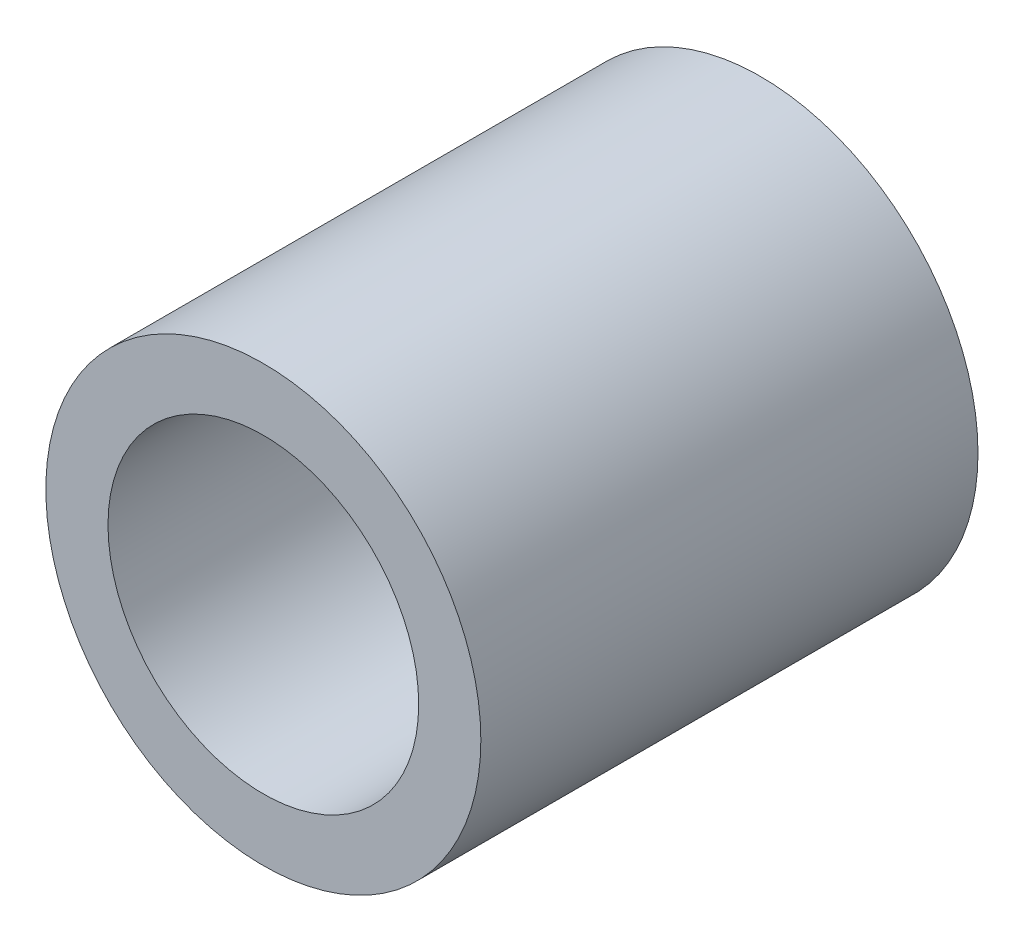
ISO-10303-21;
HEADER;
FILE_DESCRIPTION(('STEP AP214'),'2;1');
FILE_NAME('part.step','',(''),(''),'','','');
FILE_SCHEMA(('AUTOMOTIVE_DESIGN { 1 0 10303 214 1 1 1 1 }'));
ENDSEC;
DATA;
#1=APPLICATION_CONTEXT('core data for automotive mechanical design processes');
#2=APPLICATION_PROTOCOL_DEFINITION('international standard','automotive_design',2000,#1);
#3=PRODUCT_CONTEXT('',#1,'mechanical');
#4=PRODUCT('Part','Part','',(#3));
#5=PRODUCT_RELATED_PRODUCT_CATEGORY('part','',(#4));
#6=PRODUCT_DEFINITION_FORMATION('','',#4);
#7=PRODUCT_DEFINITION_CONTEXT('part definition',#1,'design');
#8=PRODUCT_DEFINITION('design','',#6,#7);
#9=PRODUCT_DEFINITION_SHAPE('','',#8);
#10=(LENGTH_UNIT() NAMED_UNIT(*) SI_UNIT(.MILLI.,.METRE.));
#11=(NAMED_UNIT(*) PLANE_ANGLE_UNIT() SI_UNIT($,.RADIAN.));
#12=(NAMED_UNIT(*) SI_UNIT($,.STERADIAN.) SOLID_ANGLE_UNIT());
#13=UNCERTAINTY_MEASURE_WITH_UNIT(LENGTH_MEASURE(1.E-05),#10,'distance_accuracy_value','');
#14=(GEOMETRIC_REPRESENTATION_CONTEXT(3) GLOBAL_UNCERTAINTY_ASSIGNED_CONTEXT((#13)) GLOBAL_UNIT_ASSIGNED_CONTEXT((#10,
#11,#12)) REPRESENTATION_CONTEXT('',''));
#15=CARTESIAN_POINT('',(0.,0.,0.));
#16=DIRECTION('',(0.,0.,1.));
#17=DIRECTION('',(1.,0.,0.));
#18=AXIS2_PLACEMENT_3D('',#15,#16,#17);
#19=CARTESIAN_POINT('',(0.,0.,20.));
#20=DIRECTION('',(0.,0.,1.));
#21=DIRECTION('',(1.,0.,0.));
#22=AXIS2_PLACEMENT_3D('',#19,#20,#21);
#23=PLANE('',#22);
#24=CARTESIAN_POINT('',(0.,0.,20.));
#25=DIRECTION('',(0.,0.,1.));
#26=DIRECTION('',(1.,0.,0.));
#27=AXIS2_PLACEMENT_3D('',#24,#25,#26);
#28=CIRCLE('',#27,8.75);
#29=CARTESIAN_POINT('',(8.75,0.,20.));
#30=VERTEX_POINT('',#29);
#31=EDGE_CURVE('E11',#30,#30,#28,.T.);
#32=ORIENTED_EDGE('',*,*,#31,.T.);
#33=EDGE_LOOP('',(#32));
#34=FACE_BOUND('',#33,.T.);
#35=CARTESIAN_POINT('',(0.,0.,20.));
#36=DIRECTION('',(0.,0.,1.));
#37=DIRECTION('',(1.,0.,0.));
#38=AXIS2_PLACEMENT_3D('',#35,#36,#37);
#39=CIRCLE('',#38,6.25);
#40=CARTESIAN_POINT('',(6.25,0.,20.));
#41=VERTEX_POINT('',#40);
#42=EDGE_CURVE('E60',#41,#41,#39,.T.);
#43=ORIENTED_EDGE('',*,*,#42,.F.);
#44=EDGE_LOOP('',(#43));
#45=FACE_BOUND('',#44,.T.);
#46=ADVANCED_FACE('F47',(#34,#45),#23,.T.);
#47=CARTESIAN_POINT('',(0.,0.,0.));
#48=DIRECTION('',(0.,0.,1.));
#49=DIRECTION('',(1.,0.,0.));
#50=AXIS2_PLACEMENT_3D('',#47,#48,#49);
#51=PLANE('',#50);
#52=CARTESIAN_POINT('',(0.,0.,0.));
#53=DIRECTION('',(0.,0.,1.));
#54=DIRECTION('',(1.,0.,0.));
#55=AXIS2_PLACEMENT_3D('',#52,#53,#54);
#56=CIRCLE('',#55,8.75);
#57=CARTESIAN_POINT('',(8.75,0.,0.));
#58=VERTEX_POINT('',#57);
#59=EDGE_CURVE('E51',#58,#58,#56,.T.);
#60=ORIENTED_EDGE('',*,*,#59,.F.);
#61=EDGE_LOOP('',(#60));
#62=FACE_BOUND('',#61,.T.);
#63=CARTESIAN_POINT('',(0.,0.,0.));
#64=DIRECTION('',(0.,0.,1.));
#65=DIRECTION('',(1.,0.,0.));
#66=AXIS2_PLACEMENT_3D('',#63,#64,#65);
#67=CIRCLE('',#66,6.25);
#68=CARTESIAN_POINT('',(6.25,0.,0.));
#69=VERTEX_POINT('',#68);
#70=EDGE_CURVE('E62',#69,#69,#67,.T.);
#71=ORIENTED_EDGE('',*,*,#70,.T.);
#72=EDGE_LOOP('',(#71));
#73=FACE_BOUND('',#72,.T.);
#74=ADVANCED_FACE('F74',(#62,#73),#51,.F.);
#75=CARTESIAN_POINT('',(0.,0.,20.));
#76=DIRECTION('',(0.,0.,-1.));
#77=DIRECTION('',(-1.,0.,0.));
#78=AXIS2_PLACEMENT_3D('',#75,#76,#77);
#79=CYLINDRICAL_SURFACE('',#78,8.75);
#80=ORIENTED_EDGE('',*,*,#31,.F.);
#81=EDGE_LOOP('',(#80));
#82=FACE_BOUND('',#81,.T.);
#83=ORIENTED_EDGE('',*,*,#59,.T.);
#84=EDGE_LOOP('',(#83));
#85=FACE_BOUND('',#84,.T.);
#86=ADVANCED_FACE('F49',(#82,#85),#79,.T.);
#87=CARTESIAN_POINT('',(0.,0.,20.));
#88=DIRECTION('',(0.,0.,-1.));
#89=DIRECTION('',(-1.,0.,0.));
#90=AXIS2_PLACEMENT_3D('',#87,#88,#89);
#91=CYLINDRICAL_SURFACE('',#90,6.25);
#92=ORIENTED_EDGE('',*,*,#42,.T.);
#93=EDGE_LOOP('',(#92));
#94=FACE_BOUND('',#93,.T.);
#95=ORIENTED_EDGE('',*,*,#70,.F.);
#96=EDGE_LOOP('',(#95));
#97=FACE_BOUND('',#96,.T.);
#98=ADVANCED_FACE('F70',(#94,#97),#91,.F.);
#99=CLOSED_SHELL('',(#46,#74,#86,#98));
#100=MANIFOLD_SOLID_BREP('B2',#99);
#101=ADVANCED_BREP_SHAPE_REPRESENTATION('',(#18,#100),#14);
#102=SHAPE_DEFINITION_REPRESENTATION(#9,#101);
ENDSEC;
END-ISO-10303-21;
